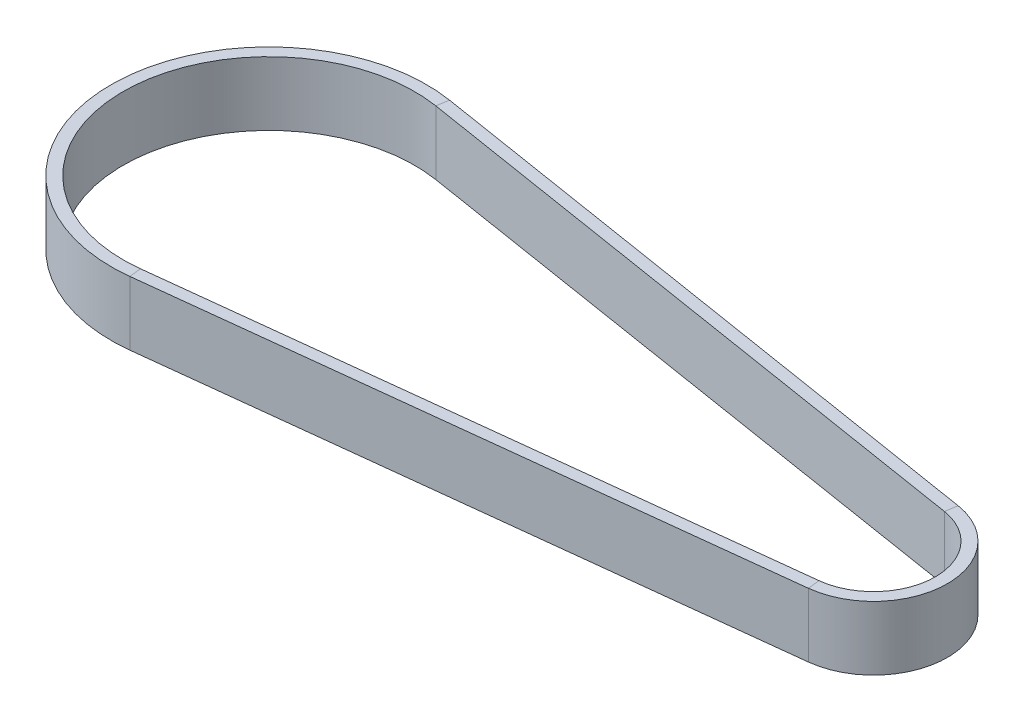
ISO-10303-21;
HEADER;
FILE_DESCRIPTION(('STEP AP214'),'2;1');
FILE_NAME('part.step','',(''),(''),'','','');
FILE_SCHEMA(('AUTOMOTIVE_DESIGN { 1 0 10303 214 1 1 1 1 }'));
ENDSEC;
DATA;
#1=APPLICATION_CONTEXT('core data for automotive mechanical design processes');
#2=APPLICATION_PROTOCOL_DEFINITION('international standard','automotive_design',2000,#1);
#3=PRODUCT_CONTEXT('',#1,'mechanical');
#4=PRODUCT('Part','Part','',(#3));
#5=PRODUCT_RELATED_PRODUCT_CATEGORY('part','',(#4));
#6=PRODUCT_DEFINITION_FORMATION('','',#4);
#7=PRODUCT_DEFINITION_CONTEXT('part definition',#1,'design');
#8=PRODUCT_DEFINITION('design','',#6,#7);
#9=PRODUCT_DEFINITION_SHAPE('','',#8);
#10=(LENGTH_UNIT() NAMED_UNIT(*) SI_UNIT(.MILLI.,.METRE.));
#11=(NAMED_UNIT(*) PLANE_ANGLE_UNIT() SI_UNIT($,.RADIAN.));
#12=(NAMED_UNIT(*) SI_UNIT($,.STERADIAN.) SOLID_ANGLE_UNIT());
#13=UNCERTAINTY_MEASURE_WITH_UNIT(LENGTH_MEASURE(1.E-05),#10,'distance_accuracy_value','');
#14=(GEOMETRIC_REPRESENTATION_CONTEXT(3) GLOBAL_UNCERTAINTY_ASSIGNED_CONTEXT((#13)) GLOBAL_UNIT_ASSIGNED_CONTEXT((#10,
#11,#12)) REPRESENTATION_CONTEXT('',''));
#15=CARTESIAN_POINT('',(0.,0.,0.));
#16=DIRECTION('',(0.,0.,1.));
#17=DIRECTION('',(1.,0.,0.));
#18=AXIS2_PLACEMENT_3D('',#15,#16,#17);
#19=CARTESIAN_POINT('',(239.751478275473,0.,-4173.93773574106));
#20=DIRECTION('',(0.,1.,0.));
#21=DIRECTION('',(0.,0.,1.));
#22=AXIS2_PLACEMENT_3D('',#19,#20,#21);
#23=CYLINDRICAL_SURFACE('',#22,36.5000000000006);
#24=DIRECTION('',(0.,-1.,0.));
#25=VECTOR('',#24,1.);
#26=CARTESIAN_POINT('',(245.521746425842,8.,-4209.9787402425));
#27=LINE('',#26,#25);
#28=CARTESIAN_POINT('',(245.521746425842,8.,-4209.9787402425));
#29=VERTEX_POINT('',#28);
#30=CARTESIAN_POINT('',(245.521746425842,-8.,-4209.9787402425));
#31=VERTEX_POINT('',#30);
#32=EDGE_CURVE('E149',#29,#31,#27,.T.);
#33=ORIENTED_EDGE('',*,*,#32,.F.);
#34=CARTESIAN_POINT('',(239.751478275473,8.,-4173.93773574106));
#35=DIRECTION('',(0.,1.,0.));
#36=DIRECTION('',(0.158089538366254,0.,-0.98742478086138));
#37=AXIS2_PLACEMENT_3D('',#34,#35,#36);
#38=CIRCLE('',#37,36.5000000000006);
#39=CARTESIAN_POINT('',(243.86894999296,8.,-4137.67072005662));
#40=VERTEX_POINT('',#39);
#41=EDGE_CURVE('E148',#29,#40,#38,.T.);
#42=ORIENTED_EDGE('',*,*,#41,.T.);
#43=DIRECTION('',(0.,-1.,0.));
#44=VECTOR('',#43,1.);
#45=CARTESIAN_POINT('',(243.86894999296,8.,-4137.67072005662));
#46=LINE('',#45,#44);
#47=CARTESIAN_POINT('',(243.86894999296,-8.,-4137.67072005662));
#48=VERTEX_POINT('',#47);
#49=EDGE_CURVE('E127',#40,#48,#46,.T.);
#50=ORIENTED_EDGE('',*,*,#49,.T.);
#51=CARTESIAN_POINT('',(239.751478275473,-8.,-4173.93773574106));
#52=DIRECTION('',(0.,1.,0.));
#53=DIRECTION('',(0.158089538366254,0.,-0.98742478086138));
#54=AXIS2_PLACEMENT_3D('',#51,#52,#53);
#55=CIRCLE('',#54,36.5000000000006);
#56=EDGE_CURVE('E153',#31,#48,#55,.T.);
#57=ORIENTED_EDGE('',*,*,#56,.F.);
#58=EDGE_LOOP('',(#33,#42,#50,#57));
#59=FACE_BOUND('',#58,.T.);
#60=ADVANCED_FACE('F33',(#59),#23,.F.);
#61=CARTESIAN_POINT('',(243.86894999296,8.,-4137.67072005662));
#62=DIRECTION('',(0.112807444314706,0.,0.993616868066955));
#63=DIRECTION('',(0.993616868066955,0.,-0.112807444314706));
#64=AXIS2_PLACEMENT_3D('',#61,#62,#63);
#65=PLANE('',#64);
#66=DIRECTION('',(0.993616868066955,0.,-0.112807444314706));
#67=VECTOR('',#66,1.);
#68=CARTESIAN_POINT('',(243.86894999296,-8.,-4137.67072005662));
#69=LINE('',#68,#67);
#70=CARTESIAN_POINT('',(396.459517684025,-8.,-4154.99465297379));
#71=VERTEX_POINT('',#70);
#72=EDGE_CURVE('E117',#48,#71,#69,.T.);
#73=ORIENTED_EDGE('',*,*,#72,.F.);
#74=ORIENTED_EDGE('',*,*,#49,.F.);
#75=DIRECTION('',(0.993616868066955,0.,-0.112807444314706));
#76=VECTOR('',#75,1.);
#77=CARTESIAN_POINT('',(243.86894999296,8.,-4137.67072005662));
#78=LINE('',#77,#76);
#79=CARTESIAN_POINT('',(396.459517684025,8.,-4154.99465297379));
#80=VERTEX_POINT('',#79);
#81=EDGE_CURVE('E130',#40,#80,#78,.T.);
#82=ORIENTED_EDGE('',*,*,#81,.T.);
#83=DIRECTION('',(0.,-1.,0.));
#84=VECTOR('',#83,1.);
#85=CARTESIAN_POINT('',(396.459517684025,8.,-4154.99465297379));
#86=LINE('',#85,#84);
#87=EDGE_CURVE('E145',#80,#71,#86,.T.);
#88=ORIENTED_EDGE('',*,*,#87,.T.);
#89=EDGE_LOOP('',(#73,#74,#82,#88));
#90=FACE_BOUND('',#89,.T.);
#91=ADVANCED_FACE('F129',(#90),#65,.F.);
#92=CARTESIAN_POINT('',(243.86894999296,-8.,-4137.67072005662));
#93=DIRECTION('',(0.,1.,0.));
#94=DIRECTION('',(0.,0.,1.));
#95=AXIS2_PLACEMENT_3D('',#92,#93,#94);
#96=PLANE('',#95);
#97=DIRECTION('',(0.993616868066955,0.,-0.112807444314706));
#98=VECTOR('',#97,1.);
#99=CARTESIAN_POINT('',(244.207372325904,-8.,-4134.68986945242));
#100=LINE('',#99,#98);
#101=CARTESIAN_POINT('',(244.207372325904,-8.,-4134.68986945242));
#102=VERTEX_POINT('',#101);
#103=CARTESIAN_POINT('',(396.797940016969,-8.,-4152.01380236959));
#104=VERTEX_POINT('',#103);
#105=EDGE_CURVE('E111',#102,#104,#100,.T.);
#106=ORIENTED_EDGE('',*,*,#105,.F.);
#107=DIRECTION('',(0.112807444314692,0.,0.993616868066956));
#108=VECTOR('',#107,1.);
#109=CARTESIAN_POINT('',(243.86894999296,-8.,-4137.67072005662));
#110=LINE('',#109,#108);
#111=EDGE_CURVE('E135',#48,#102,#110,.T.);
#112=ORIENTED_EDGE('',*,*,#111,.F.);
#113=ORIENTED_EDGE('',*,*,#72,.T.);
#114=DIRECTION('',(0.112807444314692,0.,0.993616868066956));
#115=VECTOR('',#114,1.);
#116=CARTESIAN_POINT('',(396.459517684025,-8.,-4154.99465297379));
#117=LINE('',#116,#115);
#118=EDGE_CURVE('E200',#71,#104,#117,.T.);
#119=ORIENTED_EDGE('',*,*,#118,.T.);
#120=EDGE_LOOP('',(#106,#112,#113,#119));
#121=FACE_BOUND('',#120,.T.);
#122=ADVANCED_FACE('F216',(#121),#96,.F.);
#123=CARTESIAN_POINT('',(244.207372325904,8.,-4134.68986945242));
#124=DIRECTION('',(-0.112807444314706,0.,-0.993616868066955));
#125=DIRECTION('',(-0.993616868066955,0.,0.112807444314706));
#126=AXIS2_PLACEMENT_3D('',#123,#124,#125);
#127=PLANE('',#126);
#128=DIRECTION('',(0.993616868066955,0.,-0.112807444314706));
#129=VECTOR('',#128,1.);
#130=CARTESIAN_POINT('',(244.207372325904,8.,-4134.68986945242));
#131=LINE('',#130,#129);
#132=CARTESIAN_POINT('',(244.207372325904,8.,-4134.68986945242));
#133=VERTEX_POINT('',#132);
#134=CARTESIAN_POINT('',(396.797940016969,8.,-4152.01380236959));
#135=VERTEX_POINT('',#134);
#136=EDGE_CURVE('E163',#133,#135,#131,.T.);
#137=ORIENTED_EDGE('',*,*,#136,.F.);
#138=DIRECTION('',(0.,1.,0.));
#139=VECTOR('',#138,1.);
#140=CARTESIAN_POINT('',(244.207372325904,8.,-4134.68986945242));
#141=LINE('',#140,#139);
#142=EDGE_CURVE('E156',#102,#133,#141,.T.);
#143=ORIENTED_EDGE('',*,*,#142,.F.);
#144=ORIENTED_EDGE('',*,*,#105,.T.);
#145=DIRECTION('',(0.,1.,0.));
#146=VECTOR('',#145,1.);
#147=CARTESIAN_POINT('',(396.797940016969,8.,-4152.01380236959));
#148=LINE('',#147,#146);
#149=EDGE_CURVE('E185',#104,#135,#148,.T.);
#150=ORIENTED_EDGE('',*,*,#149,.T.);
#151=EDGE_LOOP('',(#137,#143,#144,#150));
#152=FACE_BOUND('',#151,.T.);
#153=ADVANCED_FACE('F186',(#152),#127,.F.);
#154=CARTESIAN_POINT('',(243.86894999296,8.,-4137.67072005662));
#155=DIRECTION('',(0.,-1.,0.));
#156=DIRECTION('',(0.,0.,-1.));
#157=AXIS2_PLACEMENT_3D('',#154,#155,#156);
#158=PLANE('',#157);
#159=DIRECTION('',(-0.112807444314692,0.,-0.993616868066956));
#160=VECTOR('',#159,1.);
#161=CARTESIAN_POINT('',(396.459517684025,8.,-4154.99465297379));
#162=LINE('',#161,#160);
#163=EDGE_CURVE('E143',#135,#80,#162,.T.);
#164=ORIENTED_EDGE('',*,*,#163,.T.);
#165=ORIENTED_EDGE('',*,*,#81,.F.);
#166=DIRECTION('',(-0.112807444314692,0.,-0.993616868066956));
#167=VECTOR('',#166,1.);
#168=CARTESIAN_POINT('',(243.86894999296,8.,-4137.67072005662));
#169=LINE('',#168,#167);
#170=EDGE_CURVE('E142',#133,#40,#169,.T.);
#171=ORIENTED_EDGE('',*,*,#170,.F.);
#172=ORIENTED_EDGE('',*,*,#136,.T.);
#173=EDGE_LOOP('',(#164,#165,#171,#172));
#174=FACE_BOUND('',#173,.T.);
#175=ADVANCED_FACE('F140',(#174),#158,.F.);
#176=CARTESIAN_POINT('',(394.711002297147,0.,-4170.39571442882));
#177=DIRECTION('',(0.,1.,0.));
#178=DIRECTION('',(0.,0.,1.));
#179=AXIS2_PLACEMENT_3D('',#176,#177,#178);
#180=CYLINDRICAL_SURFACE('',#179,15.4999999999998);
#181=CARTESIAN_POINT('',(394.711002297147,-8.,-4170.39571442882));
#182=DIRECTION('',(0.,1.,0.));
#183=DIRECTION('',(0.112807444314412,0.,0.993616868066988));
#184=AXIS2_PLACEMENT_3D('',#181,#182,#183);
#185=CIRCLE('',#184,15.4999999999998);
#186=CARTESIAN_POINT('',(397.161390141823,-8.,-4185.70079853218));
#187=VERTEX_POINT('',#186);
#188=EDGE_CURVE('E98',#71,#187,#185,.T.);
#189=ORIENTED_EDGE('',*,*,#188,.F.);
#190=ORIENTED_EDGE('',*,*,#87,.F.);
#191=CARTESIAN_POINT('',(394.711002297147,8.,-4170.39571442882));
#192=DIRECTION('',(0.,1.,0.));
#193=DIRECTION('',(0.112807444314412,0.,0.993616868066988));
#194=AXIS2_PLACEMENT_3D('',#191,#192,#193);
#195=CIRCLE('',#194,15.4999999999998);
#196=CARTESIAN_POINT('',(397.161390141823,8.,-4185.70079853218));
#197=VERTEX_POINT('',#196);
#198=EDGE_CURVE('E162',#80,#197,#195,.T.);
#199=ORIENTED_EDGE('',*,*,#198,.T.);
#200=DIRECTION('',(0.,-1.,0.));
#201=VECTOR('',#200,1.);
#202=CARTESIAN_POINT('',(397.161390141824,8.,-4185.70079853218));
#203=LINE('',#202,#201);
#204=EDGE_CURVE('E191',#197,#187,#203,.T.);
#205=ORIENTED_EDGE('',*,*,#204,.T.);
#206=EDGE_LOOP('',(#189,#190,#199,#205));
#207=FACE_BOUND('',#206,.T.);
#208=ADVANCED_FACE('F215',(#207),#180,.F.);
#209=CARTESIAN_POINT('',(396.45951768402,-8.,-4154.99465297379));
#210=DIRECTION('',(0.,1.,0.));
#211=DIRECTION('',(0.,0.,1.));
#212=AXIS2_PLACEMENT_3D('',#209,#210,#211);
#213=PLANE('',#212);
#214=CARTESIAN_POINT('',(394.711002297147,-8.,-4170.39571442882));
#215=DIRECTION('',(0.,1.,0.));
#216=DIRECTION('',(0.112807444314458,0.,0.993616868066983));
#217=AXIS2_PLACEMENT_3D('',#214,#215,#216);
#218=CIRCLE('',#217,18.5000000000003);
#219=CARTESIAN_POINT('',(397.635658756923,-8.,-4188.66307287476));
#220=VERTEX_POINT('',#219);
#221=EDGE_CURVE('E91',#104,#220,#218,.T.);
#222=ORIENTED_EDGE('',*,*,#221,.F.);
#223=ORIENTED_EDGE('',*,*,#118,.F.);
#224=ORIENTED_EDGE('',*,*,#188,.T.);
#225=DIRECTION('',(0.158089538366275,0.,-0.987424780861377));
#226=VECTOR('',#225,1.);
#227=CARTESIAN_POINT('',(397.161390141824,-8.,-4185.70079853218));
#228=LINE('',#227,#226);
#229=EDGE_CURVE('E203',#187,#220,#228,.T.);
#230=ORIENTED_EDGE('',*,*,#229,.T.);
#231=EDGE_LOOP('',(#222,#223,#224,#230));
#232=FACE_BOUND('',#231,.T.);
#233=ADVANCED_FACE('F205',(#232),#213,.F.);
#234=CARTESIAN_POINT('',(394.711002297147,0.,-4170.39571442882));
#235=DIRECTION('',(0.,1.,0.));
#236=DIRECTION('',(0.,0.,1.));
#237=AXIS2_PLACEMENT_3D('',#234,#235,#236);
#238=CYLINDRICAL_SURFACE('',#237,18.5000000000003);
#239=CARTESIAN_POINT('',(394.711002297147,8.,-4170.39571442882));
#240=DIRECTION('',(0.,1.,0.));
#241=DIRECTION('',(0.112807444314458,0.,0.993616868066983));
#242=AXIS2_PLACEMENT_3D('',#239,#240,#241);
#243=CIRCLE('',#242,18.5000000000003);
#244=CARTESIAN_POINT('',(397.635658756923,8.,-4188.66307287476));
#245=VERTEX_POINT('',#244);
#246=EDGE_CURVE('E82',#135,#245,#243,.T.);
#247=ORIENTED_EDGE('',*,*,#246,.F.);
#248=ORIENTED_EDGE('',*,*,#149,.F.);
#249=ORIENTED_EDGE('',*,*,#221,.T.);
#250=DIRECTION('',(0.,1.,0.));
#251=VECTOR('',#250,1.);
#252=CARTESIAN_POINT('',(397.635658756923,8.,-4188.66307287476));
#253=LINE('',#252,#251);
#254=EDGE_CURVE('E169',#220,#245,#253,.T.);
#255=ORIENTED_EDGE('',*,*,#254,.T.);
#256=EDGE_LOOP('',(#247,#248,#249,#255));
#257=FACE_BOUND('',#256,.T.);
#258=ADVANCED_FACE('F187',(#257),#238,.T.);
#259=CARTESIAN_POINT('',(396.45951768402,8.,-4154.99465297379));
#260=DIRECTION('',(0.,-1.,0.));
#261=DIRECTION('',(0.,0.,-1.));
#262=AXIS2_PLACEMENT_3D('',#259,#260,#261);
#263=PLANE('',#262);
#264=DIRECTION('',(-0.158089538366275,0.,0.987424780861377));
#265=VECTOR('',#264,1.);
#266=CARTESIAN_POINT('',(397.161390141824,8.,-4185.70079853218));
#267=LINE('',#266,#265);
#268=EDGE_CURVE('E164',#245,#197,#267,.T.);
#269=ORIENTED_EDGE('',*,*,#268,.T.);
#270=ORIENTED_EDGE('',*,*,#198,.F.);
#271=ORIENTED_EDGE('',*,*,#163,.F.);
#272=ORIENTED_EDGE('',*,*,#246,.T.);
#273=EDGE_LOOP('',(#269,#270,#271,#272));
#274=FACE_BOUND('',#273,.T.);
#275=ADVANCED_FACE('F188',(#274),#263,.F.);
#276=CARTESIAN_POINT('',(397.161390141824,8.,-4185.70079853218));
#277=DIRECTION('',(0.158089538366269,0.,-0.987424780861378));
#278=DIRECTION('',(-0.987424780861378,0.,-0.158089538366269));
#279=AXIS2_PLACEMENT_3D('',#276,#277,#278);
#280=PLANE('',#279);
#281=DIRECTION('',(-0.987424780861378,0.,-0.158089538366269));
#282=VECTOR('',#281,1.);
#283=CARTESIAN_POINT('',(397.161390141824,-8.,-4185.70079853218));
#284=LINE('',#283,#282);
#285=EDGE_CURVE('E167',#187,#31,#284,.T.);
#286=ORIENTED_EDGE('',*,*,#285,.F.);
#287=ORIENTED_EDGE('',*,*,#204,.F.);
#288=DIRECTION('',(-0.987424780861378,0.,-0.158089538366269));
#289=VECTOR('',#288,1.);
#290=CARTESIAN_POINT('',(397.161390141824,8.,-4185.70079853218));
#291=LINE('',#290,#289);
#292=EDGE_CURVE('E165',#197,#29,#291,.T.);
#293=ORIENTED_EDGE('',*,*,#292,.T.);
#294=ORIENTED_EDGE('',*,*,#32,.T.);
#295=EDGE_LOOP('',(#286,#287,#293,#294));
#296=FACE_BOUND('',#295,.T.);
#297=ADVANCED_FACE('F214',(#296),#280,.F.);
#298=CARTESIAN_POINT('',(397.161390141824,-8.,-4185.70079853218));
#299=DIRECTION('',(0.,1.,0.));
#300=DIRECTION('',(0.,0.,1.));
#301=AXIS2_PLACEMENT_3D('',#298,#299,#300);
#302=PLANE('',#301);
#303=DIRECTION('',(-0.987424780861378,0.,-0.158089538366269));
#304=VECTOR('',#303,1.);
#305=CARTESIAN_POINT('',(397.635658756923,-8.,-4188.66307287476));
#306=LINE('',#305,#304);
#307=CARTESIAN_POINT('',(245.996015040941,-8.,-4212.94101458509));
#308=VERTEX_POINT('',#307);
#309=EDGE_CURVE('E58',#220,#308,#306,.T.);
#310=ORIENTED_EDGE('',*,*,#309,.F.);
#311=ORIENTED_EDGE('',*,*,#229,.F.);
#312=ORIENTED_EDGE('',*,*,#285,.T.);
#313=DIRECTION('',(0.158089538366283,0.,-0.987424780861375));
#314=VECTOR('',#313,1.);
#315=CARTESIAN_POINT('',(245.521746425842,-8.,-4209.9787402425));
#316=LINE('',#315,#314);
#317=EDGE_CURVE('E175',#31,#308,#316,.T.);
#318=ORIENTED_EDGE('',*,*,#317,.T.);
#319=EDGE_LOOP('',(#310,#311,#312,#318));
#320=FACE_BOUND('',#319,.T.);
#321=ADVANCED_FACE('F207',(#320),#302,.F.);
#322=CARTESIAN_POINT('',(397.635658756923,8.,-4188.66307287476));
#323=DIRECTION('',(-0.158089538366269,0.,0.987424780861378));
#324=DIRECTION('',(0.987424780861378,0.,0.158089538366269));
#325=AXIS2_PLACEMENT_3D('',#322,#323,#324);
#326=PLANE('',#325);
#327=DIRECTION('',(-0.987424780861378,0.,-0.158089538366269));
#328=VECTOR('',#327,1.);
#329=CARTESIAN_POINT('',(397.635658756923,8.,-4188.66307287476));
#330=LINE('',#329,#328);
#331=CARTESIAN_POINT('',(245.996015040941,8.,-4212.94101458509));
#332=VERTEX_POINT('',#331);
#333=EDGE_CURVE('E50',#245,#332,#330,.T.);
#334=ORIENTED_EDGE('',*,*,#333,.F.);
#335=ORIENTED_EDGE('',*,*,#254,.F.);
#336=ORIENTED_EDGE('',*,*,#309,.T.);
#337=DIRECTION('',(0.,1.,0.));
#338=VECTOR('',#337,1.);
#339=CARTESIAN_POINT('',(245.996015040941,8.,-4212.94101458509));
#340=LINE('',#339,#338);
#341=EDGE_CURVE('E174',#308,#332,#340,.T.);
#342=ORIENTED_EDGE('',*,*,#341,.T.);
#343=EDGE_LOOP('',(#334,#335,#336,#342));
#344=FACE_BOUND('',#343,.T.);
#345=ADVANCED_FACE('F210',(#344),#326,.F.);
#346=CARTESIAN_POINT('',(397.161390141824,8.,-4185.70079853218));
#347=DIRECTION('',(0.,-1.,0.));
#348=DIRECTION('',(0.,0.,-1.));
#349=AXIS2_PLACEMENT_3D('',#346,#347,#348);
#350=PLANE('',#349);
#351=DIRECTION('',(-0.158089538366283,0.,0.987424780861375));
#352=VECTOR('',#351,1.);
#353=CARTESIAN_POINT('',(245.521746425842,8.,-4209.9787402425));
#354=LINE('',#353,#352);
#355=EDGE_CURVE('E37',#332,#29,#354,.T.);
#356=ORIENTED_EDGE('',*,*,#355,.T.);
#357=ORIENTED_EDGE('',*,*,#292,.F.);
#358=ORIENTED_EDGE('',*,*,#268,.F.);
#359=ORIENTED_EDGE('',*,*,#333,.T.);
#360=EDGE_LOOP('',(#356,#357,#358,#359));
#361=FACE_BOUND('',#360,.T.);
#362=ADVANCED_FACE('F211',(#361),#350,.F.);
#363=CARTESIAN_POINT('',(245.521746425841,-8.,-4209.9787402425));
#364=DIRECTION('',(0.,1.,0.));
#365=DIRECTION('',(0.,0.,1.));
#366=AXIS2_PLACEMENT_3D('',#363,#364,#365);
#367=PLANE('',#366);
#368=ORIENTED_EDGE('',*,*,#56,.T.);
#369=ORIENTED_EDGE('',*,*,#111,.T.);
#370=CARTESIAN_POINT('',(239.751478275473,-8.,-4173.93773574106));
#371=DIRECTION('',(0.,1.,0.));
#372=DIRECTION('',(0.158089538366253,0.,-0.98742478086138));
#373=AXIS2_PLACEMENT_3D('',#370,#371,#372);
#374=CIRCLE('',#373,39.5000000000017);
#375=EDGE_CURVE('E42',#308,#102,#374,.T.);
#376=ORIENTED_EDGE('',*,*,#375,.F.);
#377=ORIENTED_EDGE('',*,*,#317,.F.);
#378=EDGE_LOOP('',(#368,#369,#376,#377));
#379=FACE_BOUND('',#378,.T.);
#380=ADVANCED_FACE('F219',(#379),#367,.F.);
#381=CARTESIAN_POINT('',(239.751478275473,0.,-4173.93773574106));
#382=DIRECTION('',(0.,1.,0.));
#383=DIRECTION('',(0.,0.,1.));
#384=AXIS2_PLACEMENT_3D('',#381,#382,#383);
#385=CYLINDRICAL_SURFACE('',#384,39.5000000000017);
#386=ORIENTED_EDGE('',*,*,#375,.T.);
#387=ORIENTED_EDGE('',*,*,#142,.T.);
#388=CARTESIAN_POINT('',(239.751478275473,8.,-4173.93773574106));
#389=DIRECTION('',(0.,1.,0.));
#390=DIRECTION('',(0.158089538366253,0.,-0.98742478086138));
#391=AXIS2_PLACEMENT_3D('',#388,#389,#390);
#392=CIRCLE('',#391,39.5000000000017);
#393=EDGE_CURVE('E11',#332,#133,#392,.T.);
#394=ORIENTED_EDGE('',*,*,#393,.F.);
#395=ORIENTED_EDGE('',*,*,#341,.F.);
#396=EDGE_LOOP('',(#386,#387,#394,#395));
#397=FACE_BOUND('',#396,.T.);
#398=ADVANCED_FACE('F221',(#397),#385,.T.);
#399=CARTESIAN_POINT('',(245.521746425841,8.,-4209.9787402425));
#400=DIRECTION('',(0.,-1.,0.));
#401=DIRECTION('',(0.,0.,-1.));
#402=AXIS2_PLACEMENT_3D('',#399,#400,#401);
#403=PLANE('',#402);
#404=ORIENTED_EDGE('',*,*,#393,.T.);
#405=ORIENTED_EDGE('',*,*,#170,.T.);
#406=ORIENTED_EDGE('',*,*,#41,.F.);
#407=ORIENTED_EDGE('',*,*,#355,.F.);
#408=EDGE_LOOP('',(#404,#405,#406,#407));
#409=FACE_BOUND('',#408,.T.);
#410=ADVANCED_FACE('F35',(#409),#403,.F.);
#411=CLOSED_SHELL('',(#60,#91,#122,#153,#175,#208,#233,#258,#275,#297,#321,#345,#362,#380,#398,#410));
#412=MANIFOLD_SOLID_BREP('B2',#411);
#413=ADVANCED_BREP_SHAPE_REPRESENTATION('',(#18,#412),#14);
#414=SHAPE_DEFINITION_REPRESENTATION(#9,#413);
ENDSEC;
END-ISO-10303-21;
